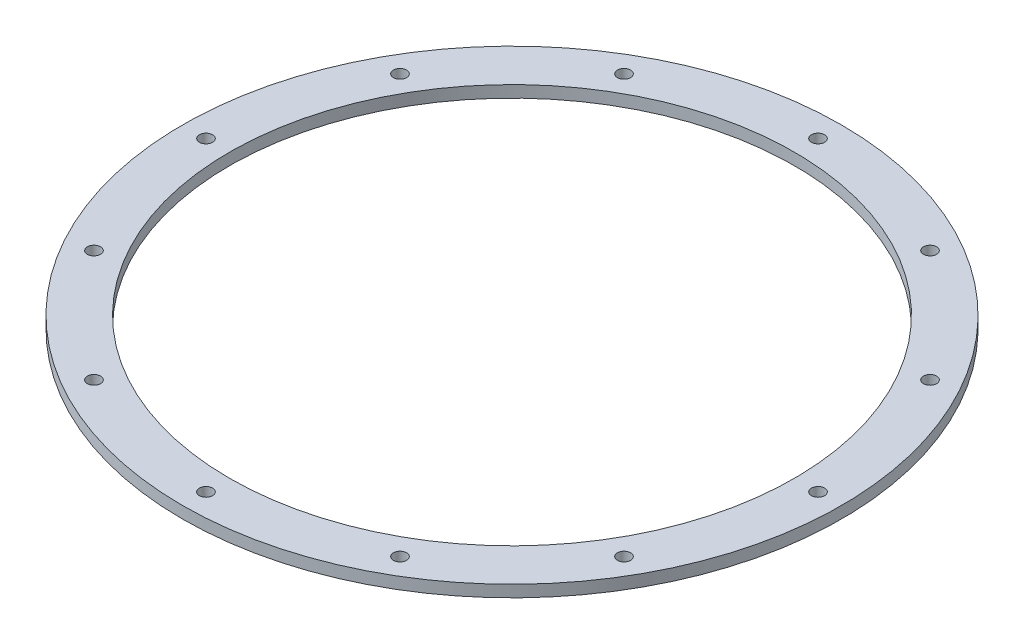
ISO-10303-21;
HEADER;
FILE_DESCRIPTION(('STEP AP214'),'2;1');
FILE_NAME('part.step','',(''),(''),'','','');
FILE_SCHEMA(('AUTOMOTIVE_DESIGN { 1 0 10303 214 1 1 1 1 }'));
ENDSEC;
DATA;
#1=APPLICATION_CONTEXT('core data for automotive mechanical design processes');
#2=APPLICATION_PROTOCOL_DEFINITION('international standard','automotive_design',2000,#1);
#3=PRODUCT_CONTEXT('',#1,'mechanical');
#4=PRODUCT('Part','Part','',(#3));
#5=PRODUCT_RELATED_PRODUCT_CATEGORY('part','',(#4));
#6=PRODUCT_DEFINITION_FORMATION('','',#4);
#7=PRODUCT_DEFINITION_CONTEXT('part definition',#1,'design');
#8=PRODUCT_DEFINITION('design','',#6,#7);
#9=PRODUCT_DEFINITION_SHAPE('','',#8);
#10=(LENGTH_UNIT() NAMED_UNIT(*) SI_UNIT(.MILLI.,.METRE.));
#11=(NAMED_UNIT(*) PLANE_ANGLE_UNIT() SI_UNIT($,.RADIAN.));
#12=(NAMED_UNIT(*) SI_UNIT($,.STERADIAN.) SOLID_ANGLE_UNIT());
#13=UNCERTAINTY_MEASURE_WITH_UNIT(LENGTH_MEASURE(1.E-05),#10,'distance_accuracy_value','');
#14=(GEOMETRIC_REPRESENTATION_CONTEXT(3) GLOBAL_UNCERTAINTY_ASSIGNED_CONTEXT((#13)) GLOBAL_UNIT_ASSIGNED_CONTEXT((#10,
#11,#12)) REPRESENTATION_CONTEXT('',''));
#15=CARTESIAN_POINT('',(0.,0.,0.));
#16=DIRECTION('',(0.,0.,1.));
#17=DIRECTION('',(1.,0.,0.));
#18=AXIS2_PLACEMENT_3D('',#15,#16,#17);
#19=CARTESIAN_POINT('',(0.,55.,0.));
#20=DIRECTION('',(0.,1.,0.));
#21=DIRECTION('',(0.,0.,1.));
#22=AXIS2_PLACEMENT_3D('',#19,#20,#21);
#23=CYLINDRICAL_SURFACE('',#22,38.1);
#24=CARTESIAN_POINT('',(0.,1.58750000000001,0.));
#25=DIRECTION('',(0.,1.,0.));
#26=DIRECTION('',(0.,0.,1.));
#27=AXIS2_PLACEMENT_3D('',#24,#25,#26);
#28=CIRCLE('',#27,38.1);
#29=CARTESIAN_POINT('',(0.,1.58750000000001,38.1));
#30=VERTEX_POINT('',#29);
#31=EDGE_CURVE('E10',#30,#30,#28,.T.);
#32=ORIENTED_EDGE('',*,*,#31,.T.);
#33=EDGE_LOOP('',(#32));
#34=FACE_BOUND('',#33,.T.);
#35=CARTESIAN_POINT('',(0.,0.,0.));
#36=DIRECTION('',(0.,1.,0.));
#37=DIRECTION('',(0.,0.,1.));
#38=AXIS2_PLACEMENT_3D('',#35,#36,#37);
#39=CIRCLE('',#38,38.1);
#40=CARTESIAN_POINT('',(0.,0.,38.1));
#41=VERTEX_POINT('',#40);
#42=EDGE_CURVE('E47',#41,#41,#39,.T.);
#43=ORIENTED_EDGE('',*,*,#42,.F.);
#44=EDGE_LOOP('',(#43));
#45=FACE_BOUND('',#44,.T.);
#46=ADVANCED_FACE('F33',(#34,#45),#23,.F.);
#47=CARTESIAN_POINT('',(-38.1,1.5875,0.));
#48=DIRECTION('',(0.,1.,0.));
#49=DIRECTION('',(0.,0.,1.));
#50=AXIS2_PLACEMENT_3D('',#47,#48,#49);
#51=PLANE('',#50);
#52=CARTESIAN_POINT('',(-35.7451985412029,1.5875,20.6374999999996));
#53=DIRECTION('',(0.,-1.,0.));
#54=DIRECTION('',(0.,0.,-1.));
#55=AXIS2_PLACEMENT_3D('',#52,#53,#54);
#56=CIRCLE('',#55,0.889000000000001);
#57=CARTESIAN_POINT('',(-35.7451985412029,1.5875,19.7484999999996));
#58=VERTEX_POINT('',#57);
#59=EDGE_CURVE('E118',#58,#58,#56,.T.);
#60=ORIENTED_EDGE('',*,*,#59,.T.);
#61=EDGE_LOOP('',(#60));
#62=FACE_BOUND('',#61,.T.);
#63=CARTESIAN_POINT('',(-20.6375000000004,1.5875,35.7451985412025));
#64=DIRECTION('',(0.,-1.,0.));
#65=DIRECTION('',(0.,0.,-1.));
#66=AXIS2_PLACEMENT_3D('',#63,#64,#65);
#67=CIRCLE('',#66,0.889000000000001);
#68=CARTESIAN_POINT('',(-20.6375000000004,1.5875,34.8561985412025));
#69=VERTEX_POINT('',#68);
#70=EDGE_CURVE('E112',#69,#69,#67,.T.);
#71=ORIENTED_EDGE('',*,*,#70,.T.);
#72=EDGE_LOOP('',(#71));
#73=FACE_BOUND('',#72,.T.);
#74=CARTESIAN_POINT('',(-3.53958818572525E-13,1.5875,41.275));
#75=DIRECTION('',(0.,-1.,0.));
#76=DIRECTION('',(0.,0.,-1.));
#77=AXIS2_PLACEMENT_3D('',#74,#75,#76);
#78=CIRCLE('',#77,0.889);
#79=CARTESIAN_POINT('',(-3.53958818572525E-13,1.5875,40.386));
#80=VERTEX_POINT('',#79);
#81=EDGE_CURVE('E106',#80,#80,#78,.T.);
#82=ORIENTED_EDGE('',*,*,#81,.T.);
#83=EDGE_LOOP('',(#82));
#84=FACE_BOUND('',#83,.T.);
#85=CARTESIAN_POINT('',(20.6374999999997,1.5875,35.7451985412029));
#86=DIRECTION('',(0.,-1.,0.));
#87=DIRECTION('',(0.,0.,-1.));
#88=AXIS2_PLACEMENT_3D('',#85,#86,#87);
#89=CIRCLE('',#88,0.889000000000001);
#90=CARTESIAN_POINT('',(20.6374999999997,1.5875,34.8561985412029));
#91=VERTEX_POINT('',#90);
#92=EDGE_CURVE('E100',#91,#91,#89,.T.);
#93=ORIENTED_EDGE('',*,*,#92,.T.);
#94=EDGE_LOOP('',(#93));
#95=FACE_BOUND('',#94,.T.);
#96=CARTESIAN_POINT('',(35.7451985412026,1.5875,20.6375000000002));
#97=DIRECTION('',(0.,-1.,0.));
#98=DIRECTION('',(0.,0.,-1.));
#99=AXIS2_PLACEMENT_3D('',#96,#97,#98);
#100=CIRCLE('',#99,0.889000000000001);
#101=CARTESIAN_POINT('',(35.7451985412026,1.5875,19.7485000000002));
#102=VERTEX_POINT('',#101);
#103=EDGE_CURVE('E94',#102,#102,#100,.T.);
#104=ORIENTED_EDGE('',*,*,#103,.T.);
#105=EDGE_LOOP('',(#104));
#106=FACE_BOUND('',#105,.T.);
#107=CARTESIAN_POINT('',(41.275,1.5875,2.28177708448336E-13));
#108=DIRECTION('',(0.,-1.,0.));
#109=DIRECTION('',(0.,0.,-1.));
#110=AXIS2_PLACEMENT_3D('',#107,#108,#109);
#111=CIRCLE('',#110,0.889000000000001);
#112=CARTESIAN_POINT('',(41.275,1.5875,-0.888999999999773));
#113=VERTEX_POINT('',#112);
#114=EDGE_CURVE('E88',#113,#113,#111,.T.);
#115=ORIENTED_EDGE('',*,*,#114,.T.);
#116=EDGE_LOOP('',(#115));
#117=FACE_BOUND('',#116,.T.);
#118=CARTESIAN_POINT('',(35.7451985412028,1.5875,-20.6374999999998));
#119=DIRECTION('',(0.,-1.,0.));
#120=DIRECTION('',(0.,0.,-1.));
#121=AXIS2_PLACEMENT_3D('',#118,#119,#120);
#122=CIRCLE('',#121,0.889000000000001);
#123=CARTESIAN_POINT('',(35.7451985412028,1.5875,-21.5264999999998));
#124=VERTEX_POINT('',#123);
#125=EDGE_CURVE('E82',#124,#124,#122,.T.);
#126=ORIENTED_EDGE('',*,*,#125,.T.);
#127=EDGE_LOOP('',(#126));
#128=FACE_BOUND('',#127,.T.);
#129=CARTESIAN_POINT('',(20.6375000000001,1.5875,-35.7451985412026));
#130=DIRECTION('',(0.,-1.,0.));
#131=DIRECTION('',(0.,0.,-1.));
#132=AXIS2_PLACEMENT_3D('',#129,#130,#131);
#133=CIRCLE('',#132,0.889000000000001);
#134=CARTESIAN_POINT('',(20.6375000000001,1.5875,-36.6341985412026));
#135=VERTEX_POINT('',#134);
#136=EDGE_CURVE('E76',#135,#135,#133,.T.);
#137=ORIENTED_EDGE('',*,*,#136,.T.);
#138=EDGE_LOOP('',(#137));
#139=FACE_BOUND('',#138,.T.);
#140=CARTESIAN_POINT('',(1.11561489392428E-13,1.5875,-41.275));
#141=DIRECTION('',(0.,-1.,0.));
#142=DIRECTION('',(0.,0.,-1.));
#143=AXIS2_PLACEMENT_3D('',#140,#141,#142);
#144=CIRCLE('',#143,0.889);
#145=CARTESIAN_POINT('',(1.11561489392428E-13,1.5875,-42.164));
#146=VERTEX_POINT('',#145);
#147=EDGE_CURVE('E70',#146,#146,#144,.T.);
#148=ORIENTED_EDGE('',*,*,#147,.T.);
#149=EDGE_LOOP('',(#148));
#150=FACE_BOUND('',#149,.T.);
#151=CARTESIAN_POINT('',(-20.6374999999999,1.5875,-35.7451985412027));
#152=DIRECTION('',(0.,-1.,0.));
#153=DIRECTION('',(0.,0.,-1.));
#154=AXIS2_PLACEMENT_3D('',#151,#152,#153);
#155=CIRCLE('',#154,0.889000000000001);
#156=CARTESIAN_POINT('',(-20.6374999999999,1.5875,-36.6341985412027));
#157=VERTEX_POINT('',#156);
#158=EDGE_CURVE('E64',#157,#157,#155,.T.);
#159=ORIENTED_EDGE('',*,*,#158,.T.);
#160=EDGE_LOOP('',(#159));
#161=FACE_BOUND('',#160,.T.);
#162=CARTESIAN_POINT('',(-35.7451985412027,1.5875,-20.6375));
#163=DIRECTION('',(0.,-1.,0.));
#164=DIRECTION('',(0.,0.,-1.));
#165=AXIS2_PLACEMENT_3D('',#162,#163,#164);
#166=CIRCLE('',#165,0.889000000000001);
#167=CARTESIAN_POINT('',(-35.7451985412027,1.5875,-21.5265));
#168=VERTEX_POINT('',#167);
#169=EDGE_CURVE('E58',#168,#168,#166,.T.);
#170=ORIENTED_EDGE('',*,*,#169,.T.);
#171=EDGE_LOOP('',(#170));
#172=FACE_BOUND('',#171,.T.);
#173=CARTESIAN_POINT('',(-41.275,1.5875,0.));
#174=DIRECTION('',(0.,-1.,0.));
#175=DIRECTION('',(0.,0.,-1.));
#176=AXIS2_PLACEMENT_3D('',#173,#174,#175);
#177=CIRCLE('',#176,0.889000000000001);
#178=CARTESIAN_POINT('',(-41.275,1.5875,-0.888999999999996));
#179=VERTEX_POINT('',#178);
#180=EDGE_CURVE('E52',#179,#179,#177,.T.);
#181=ORIENTED_EDGE('',*,*,#180,.T.);
#182=EDGE_LOOP('',(#181));
#183=FACE_BOUND('',#182,.T.);
#184=CARTESIAN_POINT('',(0.,1.58750000000001,0.));
#185=DIRECTION('',(0.,1.,0.));
#186=DIRECTION('',(0.,0.,1.));
#187=AXIS2_PLACEMENT_3D('',#184,#185,#186);
#188=CIRCLE('',#187,44.45);
#189=CARTESIAN_POINT('',(0.,1.58750000000001,44.45));
#190=VERTEX_POINT('',#189);
#191=EDGE_CURVE('E39',#190,#190,#188,.T.);
#192=ORIENTED_EDGE('',*,*,#191,.T.);
#193=EDGE_LOOP('',(#192));
#194=FACE_BOUND('',#193,.T.);
#195=ORIENTED_EDGE('',*,*,#31,.F.);
#196=EDGE_LOOP('',(#195));
#197=FACE_BOUND('',#196,.T.);
#198=ADVANCED_FACE('F161',(#62,#73,#84,#95,#106,#117,#128,#139,#150,#161,#172,#183,#194,#197),
#51,.T.);
#199=CARTESIAN_POINT('',(0.,55.,0.));
#200=DIRECTION('',(0.,1.,0.));
#201=DIRECTION('',(0.,0.,1.));
#202=AXIS2_PLACEMENT_3D('',#199,#200,#201);
#203=CYLINDRICAL_SURFACE('',#202,44.45);
#204=CARTESIAN_POINT('',(0.,0.,0.));
#205=DIRECTION('',(0.,1.,0.));
#206=DIRECTION('',(0.,0.,1.));
#207=AXIS2_PLACEMENT_3D('',#204,#205,#206);
#208=CIRCLE('',#207,44.45);
#209=CARTESIAN_POINT('',(0.,0.,44.45));
#210=VERTEX_POINT('',#209);
#211=EDGE_CURVE('E43',#210,#210,#208,.T.);
#212=ORIENTED_EDGE('',*,*,#211,.T.);
#213=EDGE_LOOP('',(#212));
#214=FACE_BOUND('',#213,.T.);
#215=ORIENTED_EDGE('',*,*,#191,.F.);
#216=EDGE_LOOP('',(#215));
#217=FACE_BOUND('',#216,.T.);
#218=ADVANCED_FACE('F131',(#214,#217),#203,.T.);
#219=CARTESIAN_POINT('',(-38.1,0.,0.));
#220=DIRECTION('',(0.,-1.,0.));
#221=DIRECTION('',(0.,0.,-1.));
#222=AXIS2_PLACEMENT_3D('',#219,#220,#221);
#223=PLANE('',#222);
#224=CARTESIAN_POINT('',(-35.7451985412029,0.,20.6374999999996));
#225=DIRECTION('',(0.,-1.,0.));
#226=DIRECTION('',(0.,0.,-1.));
#227=AXIS2_PLACEMENT_3D('',#224,#225,#226);
#228=CIRCLE('',#227,0.889000000000001);
#229=CARTESIAN_POINT('',(-35.7451985412029,0.,19.7484999999996));
#230=VERTEX_POINT('',#229);
#231=EDGE_CURVE('E121',#230,#230,#228,.T.);
#232=ORIENTED_EDGE('',*,*,#231,.F.);
#233=EDGE_LOOP('',(#232));
#234=FACE_BOUND('',#233,.T.);
#235=CARTESIAN_POINT('',(-20.6375000000004,0.,35.7451985412025));
#236=DIRECTION('',(0.,-1.,0.));
#237=DIRECTION('',(0.,0.,-1.));
#238=AXIS2_PLACEMENT_3D('',#235,#236,#237);
#239=CIRCLE('',#238,0.889000000000001);
#240=CARTESIAN_POINT('',(-20.6375000000004,0.,34.8561985412025));
#241=VERTEX_POINT('',#240);
#242=EDGE_CURVE('E115',#241,#241,#239,.T.);
#243=ORIENTED_EDGE('',*,*,#242,.F.);
#244=EDGE_LOOP('',(#243));
#245=FACE_BOUND('',#244,.T.);
#246=CARTESIAN_POINT('',(-3.53958818572525E-13,0.,41.275));
#247=DIRECTION('',(0.,-1.,0.));
#248=DIRECTION('',(0.,0.,-1.));
#249=AXIS2_PLACEMENT_3D('',#246,#247,#248);
#250=CIRCLE('',#249,0.889);
#251=CARTESIAN_POINT('',(-3.53958818572525E-13,0.,40.386));
#252=VERTEX_POINT('',#251);
#253=EDGE_CURVE('E109',#252,#252,#250,.T.);
#254=ORIENTED_EDGE('',*,*,#253,.F.);
#255=EDGE_LOOP('',(#254));
#256=FACE_BOUND('',#255,.T.);
#257=CARTESIAN_POINT('',(20.6374999999997,0.,35.7451985412029));
#258=DIRECTION('',(0.,-1.,0.));
#259=DIRECTION('',(0.,0.,-1.));
#260=AXIS2_PLACEMENT_3D('',#257,#258,#259);
#261=CIRCLE('',#260,0.889000000000001);
#262=CARTESIAN_POINT('',(20.6374999999997,0.,34.8561985412029));
#263=VERTEX_POINT('',#262);
#264=EDGE_CURVE('E103',#263,#263,#261,.T.);
#265=ORIENTED_EDGE('',*,*,#264,.F.);
#266=EDGE_LOOP('',(#265));
#267=FACE_BOUND('',#266,.T.);
#268=CARTESIAN_POINT('',(35.7451985412026,0.,20.6375000000002));
#269=DIRECTION('',(0.,-1.,0.));
#270=DIRECTION('',(0.,0.,-1.));
#271=AXIS2_PLACEMENT_3D('',#268,#269,#270);
#272=CIRCLE('',#271,0.889000000000001);
#273=CARTESIAN_POINT('',(35.7451985412026,0.,19.7485000000002));
#274=VERTEX_POINT('',#273);
#275=EDGE_CURVE('E97',#274,#274,#272,.T.);
#276=ORIENTED_EDGE('',*,*,#275,.F.);
#277=EDGE_LOOP('',(#276));
#278=FACE_BOUND('',#277,.T.);
#279=CARTESIAN_POINT('',(41.275,0.,2.28177708448336E-13));
#280=DIRECTION('',(0.,-1.,0.));
#281=DIRECTION('',(0.,0.,-1.));
#282=AXIS2_PLACEMENT_3D('',#279,#280,#281);
#283=CIRCLE('',#282,0.889000000000001);
#284=CARTESIAN_POINT('',(41.275,0.,-0.888999999999773));
#285=VERTEX_POINT('',#284);
#286=EDGE_CURVE('E91',#285,#285,#283,.T.);
#287=ORIENTED_EDGE('',*,*,#286,.F.);
#288=EDGE_LOOP('',(#287));
#289=FACE_BOUND('',#288,.T.);
#290=CARTESIAN_POINT('',(35.7451985412028,0.,-20.6374999999998));
#291=DIRECTION('',(0.,-1.,0.));
#292=DIRECTION('',(0.,0.,-1.));
#293=AXIS2_PLACEMENT_3D('',#290,#291,#292);
#294=CIRCLE('',#293,0.889000000000001);
#295=CARTESIAN_POINT('',(35.7451985412028,0.,-21.5264999999998));
#296=VERTEX_POINT('',#295);
#297=EDGE_CURVE('E85',#296,#296,#294,.T.);
#298=ORIENTED_EDGE('',*,*,#297,.F.);
#299=EDGE_LOOP('',(#298));
#300=FACE_BOUND('',#299,.T.);
#301=CARTESIAN_POINT('',(20.6375000000001,0.,-35.7451985412026));
#302=DIRECTION('',(0.,-1.,0.));
#303=DIRECTION('',(0.,0.,-1.));
#304=AXIS2_PLACEMENT_3D('',#301,#302,#303);
#305=CIRCLE('',#304,0.889000000000001);
#306=CARTESIAN_POINT('',(20.6375000000001,0.,-36.6341985412026));
#307=VERTEX_POINT('',#306);
#308=EDGE_CURVE('E79',#307,#307,#305,.T.);
#309=ORIENTED_EDGE('',*,*,#308,.F.);
#310=EDGE_LOOP('',(#309));
#311=FACE_BOUND('',#310,.T.);
#312=CARTESIAN_POINT('',(1.11561489392428E-13,0.,-41.275));
#313=DIRECTION('',(0.,-1.,0.));
#314=DIRECTION('',(0.,0.,-1.));
#315=AXIS2_PLACEMENT_3D('',#312,#313,#314);
#316=CIRCLE('',#315,0.889);
#317=CARTESIAN_POINT('',(1.11561489392428E-13,0.,-42.164));
#318=VERTEX_POINT('',#317);
#319=EDGE_CURVE('E73',#318,#318,#316,.T.);
#320=ORIENTED_EDGE('',*,*,#319,.F.);
#321=EDGE_LOOP('',(#320));
#322=FACE_BOUND('',#321,.T.);
#323=CARTESIAN_POINT('',(-20.6374999999999,0.,-35.7451985412027));
#324=DIRECTION('',(0.,-1.,0.));
#325=DIRECTION('',(0.,0.,-1.));
#326=AXIS2_PLACEMENT_3D('',#323,#324,#325);
#327=CIRCLE('',#326,0.889000000000001);
#328=CARTESIAN_POINT('',(-20.6374999999999,0.,-36.6341985412027));
#329=VERTEX_POINT('',#328);
#330=EDGE_CURVE('E67',#329,#329,#327,.T.);
#331=ORIENTED_EDGE('',*,*,#330,.F.);
#332=EDGE_LOOP('',(#331));
#333=FACE_BOUND('',#332,.T.);
#334=CARTESIAN_POINT('',(-35.7451985412027,0.,-20.6375));
#335=DIRECTION('',(0.,-1.,0.));
#336=DIRECTION('',(0.,0.,-1.));
#337=AXIS2_PLACEMENT_3D('',#334,#335,#336);
#338=CIRCLE('',#337,0.889000000000001);
#339=CARTESIAN_POINT('',(-35.7451985412027,0.,-21.5265));
#340=VERTEX_POINT('',#339);
#341=EDGE_CURVE('E61',#340,#340,#338,.T.);
#342=ORIENTED_EDGE('',*,*,#341,.F.);
#343=EDGE_LOOP('',(#342));
#344=FACE_BOUND('',#343,.T.);
#345=CARTESIAN_POINT('',(-41.275,0.,0.));
#346=DIRECTION('',(0.,-1.,0.));
#347=DIRECTION('',(0.,0.,-1.));
#348=AXIS2_PLACEMENT_3D('',#345,#346,#347);
#349=CIRCLE('',#348,0.889000000000001);
#350=CARTESIAN_POINT('',(-41.275,0.,-0.888999999999996));
#351=VERTEX_POINT('',#350);
#352=EDGE_CURVE('E55',#351,#351,#349,.T.);
#353=ORIENTED_EDGE('',*,*,#352,.F.);
#354=EDGE_LOOP('',(#353));
#355=FACE_BOUND('',#354,.T.);
#356=ORIENTED_EDGE('',*,*,#42,.T.);
#357=EDGE_LOOP('',(#356));
#358=FACE_BOUND('',#357,.T.);
#359=ORIENTED_EDGE('',*,*,#211,.F.);
#360=EDGE_LOOP('',(#359));
#361=FACE_BOUND('',#360,.T.);
#362=ADVANCED_FACE('F127',(#234,#245,#256,#267,#278,#289,#300,#311,#322,#333,#344,#355,#358,
#361),#223,.T.);
#363=CARTESIAN_POINT('',(-41.275,0.,0.));
#364=DIRECTION('',(0.,-1.,0.));
#365=DIRECTION('',(0.,0.,-1.));
#366=AXIS2_PLACEMENT_3D('',#363,#364,#365);
#367=CYLINDRICAL_SURFACE('',#366,0.889000000000001);
#368=ORIENTED_EDGE('',*,*,#180,.F.);
#369=EDGE_LOOP('',(#368));
#370=FACE_BOUND('',#369,.T.);
#371=ORIENTED_EDGE('',*,*,#352,.T.);
#372=EDGE_LOOP('',(#371));
#373=FACE_BOUND('',#372,.T.);
#374=ADVANCED_FACE('F130',(#370,#373),#367,.F.);
#375=CARTESIAN_POINT('',(-35.7451985412027,0.,-20.6375));
#376=DIRECTION('',(0.,-1.,0.));
#377=DIRECTION('',(0.,0.,-1.));
#378=AXIS2_PLACEMENT_3D('',#375,#376,#377);
#379=CYLINDRICAL_SURFACE('',#378,0.889000000000001);
#380=ORIENTED_EDGE('',*,*,#169,.F.);
#381=EDGE_LOOP('',(#380));
#382=FACE_BOUND('',#381,.T.);
#383=ORIENTED_EDGE('',*,*,#341,.T.);
#384=EDGE_LOOP('',(#383));
#385=FACE_BOUND('',#384,.T.);
#386=ADVANCED_FACE('F192',(#382,#385),#379,.F.);
#387=CARTESIAN_POINT('',(-20.6374999999999,0.,-35.7451985412027));
#388=DIRECTION('',(0.,-1.,0.));
#389=DIRECTION('',(0.,0.,-1.));
#390=AXIS2_PLACEMENT_3D('',#387,#388,#389);
#391=CYLINDRICAL_SURFACE('',#390,0.889000000000001);
#392=ORIENTED_EDGE('',*,*,#158,.F.);
#393=EDGE_LOOP('',(#392));
#394=FACE_BOUND('',#393,.T.);
#395=ORIENTED_EDGE('',*,*,#330,.T.);
#396=EDGE_LOOP('',(#395));
#397=FACE_BOUND('',#396,.T.);
#398=ADVANCED_FACE('F197',(#394,#397),#391,.F.);
#399=CARTESIAN_POINT('',(1.11561489392428E-13,0.,-41.275));
#400=DIRECTION('',(0.,-1.,0.));
#401=DIRECTION('',(0.,0.,-1.));
#402=AXIS2_PLACEMENT_3D('',#399,#400,#401);
#403=CYLINDRICAL_SURFACE('',#402,0.889);
#404=ORIENTED_EDGE('',*,*,#147,.F.);
#405=EDGE_LOOP('',(#404));
#406=FACE_BOUND('',#405,.T.);
#407=ORIENTED_EDGE('',*,*,#319,.T.);
#408=EDGE_LOOP('',(#407));
#409=FACE_BOUND('',#408,.T.);
#410=ADVANCED_FACE('F207',(#406,#409),#403,.F.);
#411=CARTESIAN_POINT('',(20.6375000000001,0.,-35.7451985412026));
#412=DIRECTION('',(0.,-1.,0.));
#413=DIRECTION('',(0.,0.,-1.));
#414=AXIS2_PLACEMENT_3D('',#411,#412,#413);
#415=CYLINDRICAL_SURFACE('',#414,0.889000000000001);
#416=ORIENTED_EDGE('',*,*,#136,.F.);
#417=EDGE_LOOP('',(#416));
#418=FACE_BOUND('',#417,.T.);
#419=ORIENTED_EDGE('',*,*,#308,.T.);
#420=EDGE_LOOP('',(#419));
#421=FACE_BOUND('',#420,.T.);
#422=ADVANCED_FACE('F217',(#418,#421),#415,.F.);
#423=CARTESIAN_POINT('',(35.7451985412028,0.,-20.6374999999998));
#424=DIRECTION('',(0.,-1.,0.));
#425=DIRECTION('',(0.,0.,-1.));
#426=AXIS2_PLACEMENT_3D('',#423,#424,#425);
#427=CYLINDRICAL_SURFACE('',#426,0.889000000000001);
#428=ORIENTED_EDGE('',*,*,#125,.F.);
#429=EDGE_LOOP('',(#428));
#430=FACE_BOUND('',#429,.T.);
#431=ORIENTED_EDGE('',*,*,#297,.T.);
#432=EDGE_LOOP('',(#431));
#433=FACE_BOUND('',#432,.T.);
#434=ADVANCED_FACE('F227',(#430,#433),#427,.F.);
#435=CARTESIAN_POINT('',(41.275,0.,2.28177708448336E-13));
#436=DIRECTION('',(0.,-1.,0.));
#437=DIRECTION('',(0.,0.,-1.));
#438=AXIS2_PLACEMENT_3D('',#435,#436,#437);
#439=CYLINDRICAL_SURFACE('',#438,0.889000000000001);
#440=ORIENTED_EDGE('',*,*,#114,.F.);
#441=EDGE_LOOP('',(#440));
#442=FACE_BOUND('',#441,.T.);
#443=ORIENTED_EDGE('',*,*,#286,.T.);
#444=EDGE_LOOP('',(#443));
#445=FACE_BOUND('',#444,.T.);
#446=ADVANCED_FACE('F237',(#442,#445),#439,.F.);
#447=CARTESIAN_POINT('',(35.7451985412026,0.,20.6375000000002));
#448=DIRECTION('',(0.,-1.,0.));
#449=DIRECTION('',(0.,0.,-1.));
#450=AXIS2_PLACEMENT_3D('',#447,#448,#449);
#451=CYLINDRICAL_SURFACE('',#450,0.889000000000001);
#452=ORIENTED_EDGE('',*,*,#103,.F.);
#453=EDGE_LOOP('',(#452));
#454=FACE_BOUND('',#453,.T.);
#455=ORIENTED_EDGE('',*,*,#275,.T.);
#456=EDGE_LOOP('',(#455));
#457=FACE_BOUND('',#456,.T.);
#458=ADVANCED_FACE('F247',(#454,#457),#451,.F.);
#459=CARTESIAN_POINT('',(20.6374999999997,0.,35.7451985412029));
#460=DIRECTION('',(0.,-1.,0.));
#461=DIRECTION('',(0.,0.,-1.));
#462=AXIS2_PLACEMENT_3D('',#459,#460,#461);
#463=CYLINDRICAL_SURFACE('',#462,0.889000000000001);
#464=ORIENTED_EDGE('',*,*,#92,.F.);
#465=EDGE_LOOP('',(#464));
#466=FACE_BOUND('',#465,.T.);
#467=ORIENTED_EDGE('',*,*,#264,.T.);
#468=EDGE_LOOP('',(#467));
#469=FACE_BOUND('',#468,.T.);
#470=ADVANCED_FACE('F257',(#466,#469),#463,.F.);
#471=CARTESIAN_POINT('',(-3.53958818572525E-13,0.,41.275));
#472=DIRECTION('',(0.,-1.,0.));
#473=DIRECTION('',(0.,0.,-1.));
#474=AXIS2_PLACEMENT_3D('',#471,#472,#473);
#475=CYLINDRICAL_SURFACE('',#474,0.889);
#476=ORIENTED_EDGE('',*,*,#81,.F.);
#477=EDGE_LOOP('',(#476));
#478=FACE_BOUND('',#477,.T.);
#479=ORIENTED_EDGE('',*,*,#253,.T.);
#480=EDGE_LOOP('',(#479));
#481=FACE_BOUND('',#480,.T.);
#482=ADVANCED_FACE('F267',(#478,#481),#475,.F.);
#483=CARTESIAN_POINT('',(-20.6375000000004,0.,35.7451985412025));
#484=DIRECTION('',(0.,-1.,0.));
#485=DIRECTION('',(0.,0.,-1.));
#486=AXIS2_PLACEMENT_3D('',#483,#484,#485);
#487=CYLINDRICAL_SURFACE('',#486,0.889000000000001);
#488=ORIENTED_EDGE('',*,*,#70,.F.);
#489=EDGE_LOOP('',(#488));
#490=FACE_BOUND('',#489,.T.);
#491=ORIENTED_EDGE('',*,*,#242,.T.);
#492=EDGE_LOOP('',(#491));
#493=FACE_BOUND('',#492,.T.);
#494=ADVANCED_FACE('F277',(#490,#493),#487,.F.);
#495=CARTESIAN_POINT('',(-35.7451985412029,0.,20.6374999999996));
#496=DIRECTION('',(0.,-1.,0.));
#497=DIRECTION('',(0.,0.,-1.));
#498=AXIS2_PLACEMENT_3D('',#495,#496,#497);
#499=CYLINDRICAL_SURFACE('',#498,0.889000000000001);
#500=ORIENTED_EDGE('',*,*,#59,.F.);
#501=EDGE_LOOP('',(#500));
#502=FACE_BOUND('',#501,.T.);
#503=ORIENTED_EDGE('',*,*,#231,.T.);
#504=EDGE_LOOP('',(#503));
#505=FACE_BOUND('',#504,.T.);
#506=ADVANCED_FACE('F125',(#502,#505),#499,.F.);
#507=CLOSED_SHELL('',(#46,#198,#218,#362,#374,#386,#398,#410,#422,#434,#446,#458,#470,#482,#494,#506));
#508=MANIFOLD_SOLID_BREP('B2',#507);
#509=ADVANCED_BREP_SHAPE_REPRESENTATION('',(#18,#508),#14);
#510=SHAPE_DEFINITION_REPRESENTATION(#9,#509);
ENDSEC;
END-ISO-10303-21;
